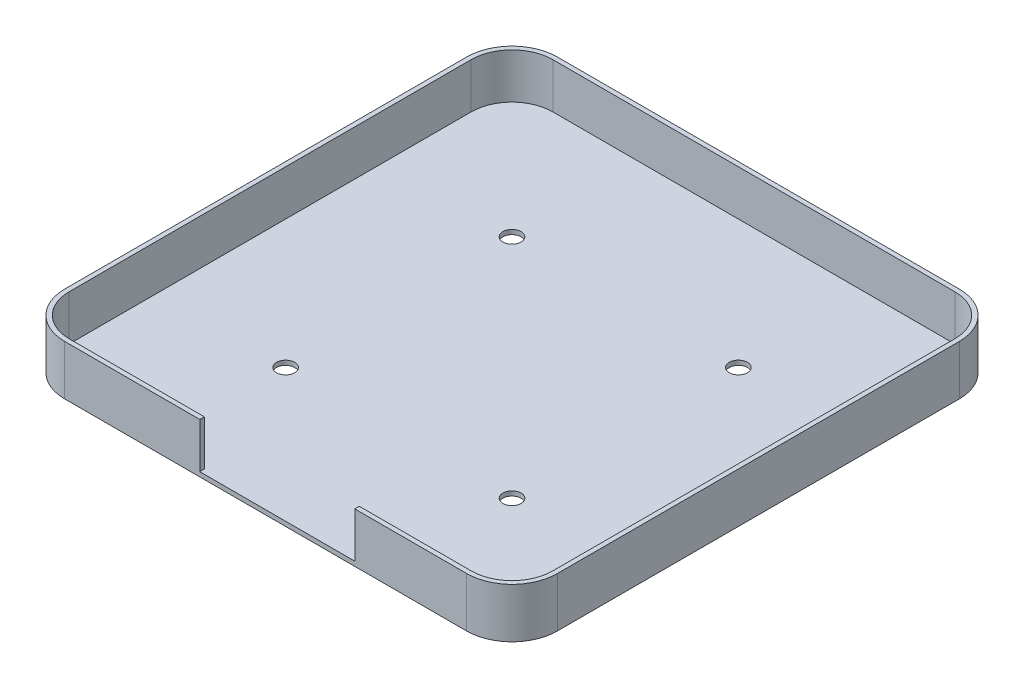
ISO-10303-21;
HEADER;
FILE_DESCRIPTION(('STEP AP214'),'2;1');
FILE_NAME('part.step','',(''),(''),'','','');
FILE_SCHEMA(('AUTOMOTIVE_DESIGN { 1 0 10303 214 1 1 1 1 }'));
ENDSEC;
DATA;
#1=APPLICATION_CONTEXT('core data for automotive mechanical design processes');
#2=APPLICATION_PROTOCOL_DEFINITION('international standard','automotive_design',2000,#1);
#3=PRODUCT_CONTEXT('',#1,'mechanical');
#4=PRODUCT('Part','Part','',(#3));
#5=PRODUCT_RELATED_PRODUCT_CATEGORY('part','',(#4));
#6=PRODUCT_DEFINITION_FORMATION('','',#4);
#7=PRODUCT_DEFINITION_CONTEXT('part definition',#1,'design');
#8=PRODUCT_DEFINITION('design','',#6,#7);
#9=PRODUCT_DEFINITION_SHAPE('','',#8);
#10=(LENGTH_UNIT() NAMED_UNIT(*) SI_UNIT(.MILLI.,.METRE.));
#11=(NAMED_UNIT(*) PLANE_ANGLE_UNIT() SI_UNIT($,.RADIAN.));
#12=(NAMED_UNIT(*) SI_UNIT($,.STERADIAN.) SOLID_ANGLE_UNIT());
#13=UNCERTAINTY_MEASURE_WITH_UNIT(LENGTH_MEASURE(1.E-05),#10,'distance_accuracy_value','');
#14=(GEOMETRIC_REPRESENTATION_CONTEXT(3) GLOBAL_UNCERTAINTY_ASSIGNED_CONTEXT((#13)) GLOBAL_UNIT_ASSIGNED_CONTEXT((#10,
#11,#12)) REPRESENTATION_CONTEXT('',''));
#15=CARTESIAN_POINT('',(0.,0.,0.));
#16=DIRECTION('',(0.,0.,1.));
#17=DIRECTION('',(1.,0.,0.));
#18=AXIS2_PLACEMENT_3D('',#15,#16,#17);
#19=CARTESIAN_POINT('',(0.,11.,53.4));
#20=DIRECTION('',(0.,0.,-1.));
#21=DIRECTION('',(-1.,0.,0.));
#22=AXIS2_PLACEMENT_3D('',#19,#20,#21);
#23=PLANE('',#22);
#24=DIRECTION('',(1.,0.,0.));
#25=VECTOR('',#24,1.);
#26=CARTESIAN_POINT('',(0.,1.,53.4));
#27=LINE('',#26,#25);
#28=CARTESIAN_POINT('',(19.6726017943409,1.,53.4));
#29=VERTEX_POINT('',#28);
#30=CARTESIAN_POINT('',(44.3999999999999,1.,53.4));
#31=VERTEX_POINT('',#30);
#32=EDGE_CURVE('E204',#29,#31,#27,.T.);
#33=ORIENTED_EDGE('',*,*,#32,.F.);
#34=DIRECTION('',(0.,-1.,0.));
#35=VECTOR('',#34,1.);
#36=CARTESIAN_POINT('',(19.6726017943409,0.,53.4));
#37=LINE('',#36,#35);
#38=CARTESIAN_POINT('',(19.6726017943409,11.,53.4));
#39=VERTEX_POINT('',#38);
#40=EDGE_CURVE('E496',#39,#29,#37,.T.);
#41=ORIENTED_EDGE('',*,*,#40,.F.);
#42=DIRECTION('',(1.,0.,0.));
#43=VECTOR('',#42,1.);
#44=CARTESIAN_POINT('',(0.,11.,53.4));
#45=LINE('',#44,#43);
#46=CARTESIAN_POINT('',(44.3999999999999,11.,53.4));
#47=VERTEX_POINT('',#46);
#48=EDGE_CURVE('E326',#39,#47,#45,.T.);
#49=ORIENTED_EDGE('',*,*,#48,.T.);
#50=DIRECTION('',(0.,-1.,0.));
#51=VECTOR('',#50,1.);
#52=CARTESIAN_POINT('',(44.3999999999999,11.,53.4));
#53=LINE('',#52,#51);
#54=EDGE_CURVE('E298',#47,#31,#53,.T.);
#55=ORIENTED_EDGE('',*,*,#54,.T.);
#56=EDGE_LOOP('',(#33,#41,#49,#55));
#57=FACE_BOUND('',#56,.T.);
#58=ADVANCED_FACE('F38',(#57),#23,.T.);
#59=CARTESIAN_POINT('',(-25.,1.,-25.));
#60=DIRECTION('',(0.,-1.,0.));
#61=DIRECTION('',(0.,0.,-1.));
#62=AXIS2_PLACEMENT_3D('',#59,#60,#61);
#63=CYLINDRICAL_SURFACE('',#62,2.);
#64=CARTESIAN_POINT('',(-25.,1.,-25.));
#65=DIRECTION('',(0.,1.,0.));
#66=DIRECTION('',(0.,0.,1.));
#67=AXIS2_PLACEMENT_3D('',#64,#65,#66);
#68=CIRCLE('',#67,2.);
#69=CARTESIAN_POINT('',(-25.,1.,-23.));
#70=VERTEX_POINT('',#69);
#71=EDGE_CURVE('E47',#70,#70,#68,.T.);
#72=ORIENTED_EDGE('',*,*,#71,.T.);
#73=EDGE_LOOP('',(#72));
#74=FACE_BOUND('',#73,.T.);
#75=CARTESIAN_POINT('',(-25.,0.,-25.));
#76=DIRECTION('',(0.,1.,0.));
#77=DIRECTION('',(0.,0.,1.));
#78=AXIS2_PLACEMENT_3D('',#75,#76,#77);
#79=CIRCLE('',#78,2.);
#80=CARTESIAN_POINT('',(-25.,0.,-23.));
#81=VERTEX_POINT('',#80);
#82=EDGE_CURVE('E236',#81,#81,#79,.T.);
#83=ORIENTED_EDGE('',*,*,#82,.F.);
#84=EDGE_LOOP('',(#83));
#85=FACE_BOUND('',#84,.T.);
#86=ADVANCED_FACE('F399',(#74,#85),#63,.F.);
#87=CARTESIAN_POINT('',(25.,1.,-25.));
#88=DIRECTION('',(0.,-1.,0.));
#89=DIRECTION('',(0.,0.,-1.));
#90=AXIS2_PLACEMENT_3D('',#87,#88,#89);
#91=CYLINDRICAL_SURFACE('',#90,2.);
#92=CARTESIAN_POINT('',(25.,1.,-25.));
#93=DIRECTION('',(0.,1.,0.));
#94=DIRECTION('',(0.,0.,1.));
#95=AXIS2_PLACEMENT_3D('',#92,#93,#94);
#96=CIRCLE('',#95,2.);
#97=CARTESIAN_POINT('',(25.,1.,-23.));
#98=VERTEX_POINT('',#97);
#99=EDGE_CURVE('E225',#98,#98,#96,.T.);
#100=ORIENTED_EDGE('',*,*,#99,.T.);
#101=EDGE_LOOP('',(#100));
#102=FACE_BOUND('',#101,.T.);
#103=CARTESIAN_POINT('',(25.,0.,-25.));
#104=DIRECTION('',(0.,1.,0.));
#105=DIRECTION('',(0.,0.,1.));
#106=AXIS2_PLACEMENT_3D('',#103,#104,#105);
#107=CIRCLE('',#106,2.);
#108=CARTESIAN_POINT('',(25.,0.,-23.));
#109=VERTEX_POINT('',#108);
#110=EDGE_CURVE('E233',#109,#109,#107,.T.);
#111=ORIENTED_EDGE('',*,*,#110,.F.);
#112=EDGE_LOOP('',(#111));
#113=FACE_BOUND('',#112,.T.);
#114=ADVANCED_FACE('F404',(#102,#113),#91,.F.);
#115=CARTESIAN_POINT('',(25.,1.,25.));
#116=DIRECTION('',(0.,-1.,0.));
#117=DIRECTION('',(0.,0.,-1.));
#118=AXIS2_PLACEMENT_3D('',#115,#116,#117);
#119=CYLINDRICAL_SURFACE('',#118,2.);
#120=CARTESIAN_POINT('',(25.,1.,25.));
#121=DIRECTION('',(0.,1.,0.));
#122=DIRECTION('',(0.,0.,1.));
#123=AXIS2_PLACEMENT_3D('',#120,#121,#122);
#124=CIRCLE('',#123,2.);
#125=CARTESIAN_POINT('',(25.,1.,27.));
#126=VERTEX_POINT('',#125);
#127=EDGE_CURVE('E222',#126,#126,#124,.F.);
#128=ORIENTED_EDGE('',*,*,#127,.F.);
#129=EDGE_LOOP('',(#128));
#130=FACE_BOUND('',#129,.T.);
#131=CARTESIAN_POINT('',(25.,0.,25.));
#132=DIRECTION('',(0.,1.,0.));
#133=DIRECTION('',(0.,0.,1.));
#134=AXIS2_PLACEMENT_3D('',#131,#132,#133);
#135=CIRCLE('',#134,2.);
#136=CARTESIAN_POINT('',(25.,0.,27.));
#137=VERTEX_POINT('',#136);
#138=EDGE_CURVE('E230',#137,#137,#135,.F.);
#139=ORIENTED_EDGE('',*,*,#138,.T.);
#140=EDGE_LOOP('',(#139));
#141=FACE_BOUND('',#140,.T.);
#142=ADVANCED_FACE('F40',(#130,#141),#119,.F.);
#143=CARTESIAN_POINT('',(-25.,1.,25.));
#144=DIRECTION('',(0.,-1.,0.));
#145=DIRECTION('',(0.,0.,-1.));
#146=AXIS2_PLACEMENT_3D('',#143,#144,#145);
#147=CYLINDRICAL_SURFACE('',#146,2.);
#148=CARTESIAN_POINT('',(-25.,1.,25.));
#149=DIRECTION('',(0.,1.,0.));
#150=DIRECTION('',(0.,0.,1.));
#151=AXIS2_PLACEMENT_3D('',#148,#149,#150);
#152=CIRCLE('',#151,2.);
#153=CARTESIAN_POINT('',(-25.,1.,27.));
#154=VERTEX_POINT('',#153);
#155=EDGE_CURVE('E11',#154,#154,#152,.F.);
#156=ORIENTED_EDGE('',*,*,#155,.F.);
#157=EDGE_LOOP('',(#156));
#158=FACE_BOUND('',#157,.T.);
#159=CARTESIAN_POINT('',(-25.,0.,25.));
#160=DIRECTION('',(0.,1.,0.));
#161=DIRECTION('',(0.,0.,1.));
#162=AXIS2_PLACEMENT_3D('',#159,#160,#161);
#163=CIRCLE('',#162,2.);
#164=CARTESIAN_POINT('',(-25.,0.,27.));
#165=VERTEX_POINT('',#164);
#166=EDGE_CURVE('E42',#165,#165,#163,.F.);
#167=ORIENTED_EDGE('',*,*,#166,.T.);
#168=EDGE_LOOP('',(#167));
#169=FACE_BOUND('',#168,.T.);
#170=ADVANCED_FACE('F420',(#158,#169),#147,.F.);
#171=CARTESIAN_POINT('',(0.,1.,0.));
#172=DIRECTION('',(0.,1.,0.));
#173=DIRECTION('',(0.,0.,1.));
#174=AXIS2_PLACEMENT_3D('',#171,#172,#173);
#175=PLANE('',#174);
#176=CARTESIAN_POINT('',(-44.4,1.,44.4));
#177=DIRECTION('',(0.,1.,0.));
#178=DIRECTION('',(0.,0.,1.));
#179=AXIS2_PLACEMENT_3D('',#176,#177,#178);
#180=CIRCLE('',#179,9.);
#181=CARTESIAN_POINT('',(-44.3999999999999,1.,53.4));
#182=VERTEX_POINT('',#181);
#183=CARTESIAN_POINT('',(-53.4,1.,44.3999999999999));
#184=VERTEX_POINT('',#183);
#185=EDGE_CURVE('E202',#182,#184,#180,.F.);
#186=ORIENTED_EDGE('',*,*,#185,.F.);
#187=CARTESIAN_POINT('',(-14.5573982056591,1.,53.4));
#188=VERTEX_POINT('',#187);
#189=EDGE_CURVE('E193',#182,#188,#27,.T.);
#190=ORIENTED_EDGE('',*,*,#189,.T.);
#191=DIRECTION('',(0.,0.,1.));
#192=VECTOR('',#191,1.);
#193=CARTESIAN_POINT('',(-14.5573982056591,1.,17.7391965878501));
#194=LINE('',#193,#192);
#195=CARTESIAN_POINT('',(-14.5573982056591,1.,54.4));
#196=VERTEX_POINT('',#195);
#197=EDGE_CURVE('E177',#188,#196,#194,.T.);
#198=ORIENTED_EDGE('',*,*,#197,.T.);
#199=DIRECTION('',(-1.,0.,0.));
#200=VECTOR('',#199,1.);
#201=CARTESIAN_POINT('',(0.,1.,54.4));
#202=LINE('',#201,#200);
#203=CARTESIAN_POINT('',(19.6726017943409,1.,54.4));
#204=VERTEX_POINT('',#203);
#205=EDGE_CURVE('E499',#204,#196,#202,.T.);
#206=ORIENTED_EDGE('',*,*,#205,.F.);
#207=DIRECTION('',(0.,0.,1.));
#208=VECTOR('',#207,1.);
#209=CARTESIAN_POINT('',(19.6726017943409,1.,17.7391965878501));
#210=LINE('',#209,#208);
#211=EDGE_CURVE('E188',#29,#204,#210,.T.);
#212=ORIENTED_EDGE('',*,*,#211,.F.);
#213=ORIENTED_EDGE('',*,*,#32,.T.);
#214=CARTESIAN_POINT('',(44.4,1.,44.4));
#215=DIRECTION('',(0.,1.,0.));
#216=DIRECTION('',(0.,0.,1.));
#217=AXIS2_PLACEMENT_3D('',#214,#215,#216);
#218=CIRCLE('',#217,9.);
#219=CARTESIAN_POINT('',(53.4,1.,44.3999999999999));
#220=VERTEX_POINT('',#219);
#221=EDGE_CURVE('E203',#31,#220,#218,.T.);
#222=ORIENTED_EDGE('',*,*,#221,.T.);
#223=DIRECTION('',(0.,0.,-1.));
#224=VECTOR('',#223,1.);
#225=CARTESIAN_POINT('',(53.4,1.,0.));
#226=LINE('',#225,#224);
#227=CARTESIAN_POINT('',(53.4,1.,-44.3999999999999));
#228=VERTEX_POINT('',#227);
#229=EDGE_CURVE('E207',#220,#228,#226,.T.);
#230=ORIENTED_EDGE('',*,*,#229,.T.);
#231=CARTESIAN_POINT('',(44.4,1.,-44.4));
#232=DIRECTION('',(0.,1.,0.));
#233=DIRECTION('',(0.,0.,1.));
#234=AXIS2_PLACEMENT_3D('',#231,#232,#233);
#235=CIRCLE('',#234,9.);
#236=CARTESIAN_POINT('',(44.3999999999999,1.,-53.4));
#237=VERTEX_POINT('',#236);
#238=EDGE_CURVE('E214',#237,#228,#235,.F.);
#239=ORIENTED_EDGE('',*,*,#238,.F.);
#240=DIRECTION('',(1.,0.,0.));
#241=VECTOR('',#240,1.);
#242=CARTESIAN_POINT('',(0.,1.,-53.4));
#243=LINE('',#242,#241);
#244=CARTESIAN_POINT('',(-44.3999999999999,1.,-53.4));
#245=VERTEX_POINT('',#244);
#246=EDGE_CURVE('E216',#245,#237,#243,.T.);
#247=ORIENTED_EDGE('',*,*,#246,.F.);
#248=CARTESIAN_POINT('',(-44.4,1.,-44.4));
#249=DIRECTION('',(0.,1.,0.));
#250=DIRECTION('',(0.,0.,1.));
#251=AXIS2_PLACEMENT_3D('',#248,#249,#250);
#252=CIRCLE('',#251,9.);
#253=CARTESIAN_POINT('',(-53.4,1.,-44.3999999999999));
#254=VERTEX_POINT('',#253);
#255=EDGE_CURVE('E218',#254,#245,#252,.F.);
#256=ORIENTED_EDGE('',*,*,#255,.F.);
#257=DIRECTION('',(0.,0.,-1.));
#258=VECTOR('',#257,1.);
#259=CARTESIAN_POINT('',(-53.4,1.,0.));
#260=LINE('',#259,#258);
#261=EDGE_CURVE('E220',#184,#254,#260,.T.);
#262=ORIENTED_EDGE('',*,*,#261,.F.);
#263=EDGE_LOOP('',(#186,#190,#198,#206,#212,#213,#222,#230,#239,#247,#256,#262));
#264=FACE_BOUND('',#263,.T.);
#265=ORIENTED_EDGE('',*,*,#127,.T.);
#266=EDGE_LOOP('',(#265));
#267=FACE_BOUND('',#266,.T.);
#268=ORIENTED_EDGE('',*,*,#99,.F.);
#269=EDGE_LOOP('',(#268));
#270=FACE_BOUND('',#269,.T.);
#271=ORIENTED_EDGE('',*,*,#71,.F.);
#272=EDGE_LOOP('',(#271));
#273=FACE_BOUND('',#272,.T.);
#274=ORIENTED_EDGE('',*,*,#155,.T.);
#275=EDGE_LOOP('',(#274));
#276=FACE_BOUND('',#275,.T.);
#277=ADVANCED_FACE('F199',(#264,#267,#270,#273,#276),#175,.T.);
#278=CARTESIAN_POINT('',(0.,0.,0.));
#279=DIRECTION('',(0.,1.,0.));
#280=DIRECTION('',(0.,0.,1.));
#281=AXIS2_PLACEMENT_3D('',#278,#279,#280);
#282=PLANE('',#281);
#283=ORIENTED_EDGE('',*,*,#138,.F.);
#284=EDGE_LOOP('',(#283));
#285=FACE_BOUND('',#284,.T.);
#286=ORIENTED_EDGE('',*,*,#110,.T.);
#287=EDGE_LOOP('',(#286));
#288=FACE_BOUND('',#287,.T.);
#289=ORIENTED_EDGE('',*,*,#82,.T.);
#290=EDGE_LOOP('',(#289));
#291=FACE_BOUND('',#290,.T.);
#292=ORIENTED_EDGE('',*,*,#166,.F.);
#293=EDGE_LOOP('',(#292));
#294=FACE_BOUND('',#293,.T.);
#295=CARTESIAN_POINT('',(-44.4,0.,-44.4));
#296=DIRECTION('',(0.,1.,0.));
#297=DIRECTION('',(0.,0.,1.));
#298=AXIS2_PLACEMENT_3D('',#295,#296,#297);
#299=CIRCLE('',#298,10.);
#300=CARTESIAN_POINT('',(-54.4,0.,-44.3999999999999));
#301=VERTEX_POINT('',#300);
#302=CARTESIAN_POINT('',(-44.3999999999999,0.,-54.4));
#303=VERTEX_POINT('',#302);
#304=EDGE_CURVE('E332',#301,#303,#299,.F.);
#305=ORIENTED_EDGE('',*,*,#304,.T.);
#306=DIRECTION('',(1.,0.,0.));
#307=VECTOR('',#306,1.);
#308=CARTESIAN_POINT('',(0.,0.,-54.4));
#309=LINE('',#308,#307);
#310=CARTESIAN_POINT('',(44.3999999999999,0.,-54.4));
#311=VERTEX_POINT('',#310);
#312=EDGE_CURVE('E310',#303,#311,#309,.T.);
#313=ORIENTED_EDGE('',*,*,#312,.T.);
#314=CARTESIAN_POINT('',(44.4,0.,-44.4));
#315=DIRECTION('',(0.,1.,0.));
#316=DIRECTION('',(0.,0.,1.));
#317=AXIS2_PLACEMENT_3D('',#314,#315,#316);
#318=CIRCLE('',#317,10.);
#319=CARTESIAN_POINT('',(54.4,0.,-44.3999999999999));
#320=VERTEX_POINT('',#319);
#321=EDGE_CURVE('E348',#311,#320,#318,.F.);
#322=ORIENTED_EDGE('',*,*,#321,.T.);
#323=DIRECTION('',(0.,0.,-1.));
#324=VECTOR('',#323,1.);
#325=CARTESIAN_POINT('',(54.4,0.,0.));
#326=LINE('',#325,#324);
#327=CARTESIAN_POINT('',(54.4,0.,44.3999999999999));
#328=VERTEX_POINT('',#327);
#329=EDGE_CURVE('E346',#328,#320,#326,.T.);
#330=ORIENTED_EDGE('',*,*,#329,.F.);
#331=CARTESIAN_POINT('',(44.4,0.,44.4));
#332=DIRECTION('',(0.,1.,0.));
#333=DIRECTION('',(0.,0.,1.));
#334=AXIS2_PLACEMENT_3D('',#331,#332,#333);
#335=CIRCLE('',#334,10.);
#336=CARTESIAN_POINT('',(44.3999999999999,0.,54.4));
#337=VERTEX_POINT('',#336);
#338=EDGE_CURVE('E344',#337,#328,#335,.T.);
#339=ORIENTED_EDGE('',*,*,#338,.F.);
#340=DIRECTION('',(1.,0.,0.));
#341=VECTOR('',#340,1.);
#342=CARTESIAN_POINT('',(0.,0.,54.4));
#343=LINE('',#342,#341);
#344=CARTESIAN_POINT('',(-44.3999999999999,0.,54.4));
#345=VERTEX_POINT('',#344);
#346=EDGE_CURVE('E342',#345,#337,#343,.T.);
#347=ORIENTED_EDGE('',*,*,#346,.F.);
#348=CARTESIAN_POINT('',(-44.4,0.,44.4));
#349=DIRECTION('',(0.,1.,0.));
#350=DIRECTION('',(0.,0.,1.));
#351=AXIS2_PLACEMENT_3D('',#348,#349,#350);
#352=CIRCLE('',#351,10.);
#353=CARTESIAN_POINT('',(-54.4,0.,44.3999999999999));
#354=VERTEX_POINT('',#353);
#355=EDGE_CURVE('E339',#345,#354,#352,.F.);
#356=ORIENTED_EDGE('',*,*,#355,.T.);
#357=DIRECTION('',(0.,0.,-1.));
#358=VECTOR('',#357,1.);
#359=CARTESIAN_POINT('',(-54.4,0.,0.));
#360=LINE('',#359,#358);
#361=EDGE_CURVE('E335',#354,#301,#360,.T.);
#362=ORIENTED_EDGE('',*,*,#361,.T.);
#363=EDGE_LOOP('',(#305,#313,#322,#330,#339,#347,#356,#362));
#364=FACE_BOUND('',#363,.T.);
#365=ADVANCED_FACE('F410',(#285,#288,#291,#294,#364),#282,.F.);
#366=DIRECTION('',(0.,-1.,0.));
#367=VECTOR('',#366,1.);
#368=CARTESIAN_POINT('',(-14.5573982056591,0.,53.4));
#369=LINE('',#368,#367);
#370=CARTESIAN_POINT('',(-14.5573982056591,11.,53.4));
#371=VERTEX_POINT('',#370);
#372=EDGE_CURVE('E180',#371,#188,#369,.T.);
#373=ORIENTED_EDGE('',*,*,#372,.T.);
#374=ORIENTED_EDGE('',*,*,#189,.F.);
#375=DIRECTION('',(0.,-1.,0.));
#376=VECTOR('',#375,1.);
#377=CARTESIAN_POINT('',(-44.3999999999999,11.,53.4));
#378=LINE('',#377,#376);
#379=CARTESIAN_POINT('',(-44.3999999999999,11.,53.4));
#380=VERTEX_POINT('',#379);
#381=EDGE_CURVE('E234',#380,#182,#378,.T.);
#382=ORIENTED_EDGE('',*,*,#381,.F.);
#383=EDGE_CURVE('E196',#380,#371,#45,.T.);
#384=ORIENTED_EDGE('',*,*,#383,.T.);
#385=EDGE_LOOP('',(#373,#374,#382,#384));
#386=FACE_BOUND('',#385,.T.);
#387=ADVANCED_FACE('F192',(#386),#23,.T.);
#388=CARTESIAN_POINT('',(-44.4,11.,44.4));
#389=DIRECTION('',(0.,-1.,0.));
#390=DIRECTION('',(0.,0.,-1.));
#391=AXIS2_PLACEMENT_3D('',#388,#389,#390);
#392=CYLINDRICAL_SURFACE('',#391,9.);
#393=ORIENTED_EDGE('',*,*,#185,.T.);
#394=DIRECTION('',(0.,-1.,0.));
#395=VECTOR('',#394,1.);
#396=CARTESIAN_POINT('',(-53.4,11.,44.3999999999999));
#397=LINE('',#396,#395);
#398=CARTESIAN_POINT('',(-53.4,11.,44.3999999999999));
#399=VERTEX_POINT('',#398);
#400=EDGE_CURVE('E248',#399,#184,#397,.T.);
#401=ORIENTED_EDGE('',*,*,#400,.F.);
#402=CARTESIAN_POINT('',(-44.4,11.,44.4));
#403=DIRECTION('',(0.,1.,0.));
#404=DIRECTION('',(0.,0.,1.));
#405=AXIS2_PLACEMENT_3D('',#402,#403,#404);
#406=CIRCLE('',#405,9.);
#407=EDGE_CURVE('E383',#380,#399,#406,.F.);
#408=ORIENTED_EDGE('',*,*,#407,.F.);
#409=ORIENTED_EDGE('',*,*,#381,.T.);
#410=EDGE_LOOP('',(#393,#401,#408,#409));
#411=FACE_BOUND('',#410,.T.);
#412=ADVANCED_FACE('F246',(#411),#392,.F.);
#413=CARTESIAN_POINT('',(-53.4,11.,0.));
#414=DIRECTION('',(-1.,0.,0.));
#415=DIRECTION('',(0.,0.,1.));
#416=AXIS2_PLACEMENT_3D('',#413,#414,#415);
#417=PLANE('',#416);
#418=ORIENTED_EDGE('',*,*,#261,.T.);
#419=DIRECTION('',(0.,-1.,0.));
#420=VECTOR('',#419,1.);
#421=CARTESIAN_POINT('',(-53.4,11.,-44.3999999999999));
#422=LINE('',#421,#420);
#423=CARTESIAN_POINT('',(-53.4,11.,-44.3999999999999));
#424=VERTEX_POINT('',#423);
#425=EDGE_CURVE('E256',#424,#254,#422,.T.);
#426=ORIENTED_EDGE('',*,*,#425,.F.);
#427=DIRECTION('',(0.,0.,-1.));
#428=VECTOR('',#427,1.);
#429=CARTESIAN_POINT('',(-53.4,11.,0.));
#430=LINE('',#429,#428);
#431=EDGE_CURVE('E254',#399,#424,#430,.T.);
#432=ORIENTED_EDGE('',*,*,#431,.F.);
#433=ORIENTED_EDGE('',*,*,#400,.T.);
#434=EDGE_LOOP('',(#418,#426,#432,#433));
#435=FACE_BOUND('',#434,.T.);
#436=ADVANCED_FACE('F250',(#435),#417,.F.);
#437=CARTESIAN_POINT('',(-44.4,11.,-44.4));
#438=DIRECTION('',(0.,-1.,0.));
#439=DIRECTION('',(0.,0.,-1.));
#440=AXIS2_PLACEMENT_3D('',#437,#438,#439);
#441=CYLINDRICAL_SURFACE('',#440,9.);
#442=ORIENTED_EDGE('',*,*,#255,.T.);
#443=DIRECTION('',(0.,-1.,0.));
#444=VECTOR('',#443,1.);
#445=CARTESIAN_POINT('',(-44.3999999999999,11.,-53.4));
#446=LINE('',#445,#444);
#447=CARTESIAN_POINT('',(-44.3999999999999,11.,-53.4));
#448=VERTEX_POINT('',#447);
#449=EDGE_CURVE('E265',#448,#245,#446,.T.);
#450=ORIENTED_EDGE('',*,*,#449,.F.);
#451=CARTESIAN_POINT('',(-44.4,11.,-44.4));
#452=DIRECTION('',(0.,1.,0.));
#453=DIRECTION('',(0.,0.,1.));
#454=AXIS2_PLACEMENT_3D('',#451,#452,#453);
#455=CIRCLE('',#454,9.);
#456=EDGE_CURVE('E386',#424,#448,#455,.F.);
#457=ORIENTED_EDGE('',*,*,#456,.F.);
#458=ORIENTED_EDGE('',*,*,#425,.T.);
#459=EDGE_LOOP('',(#442,#450,#457,#458));
#460=FACE_BOUND('',#459,.T.);
#461=ADVANCED_FACE('F264',(#460),#441,.F.);
#462=CARTESIAN_POINT('',(0.,11.,-53.4));
#463=DIRECTION('',(0.,0.,-1.));
#464=DIRECTION('',(-1.,0.,0.));
#465=AXIS2_PLACEMENT_3D('',#462,#463,#464);
#466=PLANE('',#465);
#467=ORIENTED_EDGE('',*,*,#246,.T.);
#468=DIRECTION('',(0.,-1.,0.));
#469=VECTOR('',#468,1.);
#470=CARTESIAN_POINT('',(44.3999999999999,11.,-53.4));
#471=LINE('',#470,#469);
#472=CARTESIAN_POINT('',(44.3999999999999,11.,-53.4));
#473=VERTEX_POINT('',#472);
#474=EDGE_CURVE('E273',#473,#237,#471,.T.);
#475=ORIENTED_EDGE('',*,*,#474,.F.);
#476=DIRECTION('',(1.,0.,0.));
#477=VECTOR('',#476,1.);
#478=CARTESIAN_POINT('',(0.,11.,-53.4));
#479=LINE('',#478,#477);
#480=EDGE_CURVE('E271',#448,#473,#479,.T.);
#481=ORIENTED_EDGE('',*,*,#480,.F.);
#482=ORIENTED_EDGE('',*,*,#449,.T.);
#483=EDGE_LOOP('',(#467,#475,#481,#482));
#484=FACE_BOUND('',#483,.T.);
#485=ADVANCED_FACE('F267',(#484),#466,.F.);
#486=CARTESIAN_POINT('',(44.4,11.,-44.4));
#487=DIRECTION('',(0.,-1.,0.));
#488=DIRECTION('',(0.,0.,-1.));
#489=AXIS2_PLACEMENT_3D('',#486,#487,#488);
#490=CYLINDRICAL_SURFACE('',#489,9.);
#491=ORIENTED_EDGE('',*,*,#238,.T.);
#492=DIRECTION('',(0.,-1.,0.));
#493=VECTOR('',#492,1.);
#494=CARTESIAN_POINT('',(53.4,11.,-44.3999999999999));
#495=LINE('',#494,#493);
#496=CARTESIAN_POINT('',(53.4,11.,-44.3999999999999));
#497=VERTEX_POINT('',#496);
#498=EDGE_CURVE('E276',#497,#228,#495,.T.);
#499=ORIENTED_EDGE('',*,*,#498,.F.);
#500=CARTESIAN_POINT('',(44.4,11.,-44.4));
#501=DIRECTION('',(0.,1.,0.));
#502=DIRECTION('',(0.,0.,1.));
#503=AXIS2_PLACEMENT_3D('',#500,#501,#502);
#504=CIRCLE('',#503,9.);
#505=EDGE_CURVE('E328',#473,#497,#504,.F.);
#506=ORIENTED_EDGE('',*,*,#505,.F.);
#507=ORIENTED_EDGE('',*,*,#474,.T.);
#508=EDGE_LOOP('',(#491,#499,#506,#507));
#509=FACE_BOUND('',#508,.T.);
#510=ADVANCED_FACE('F388',(#509),#490,.F.);
#511=CARTESIAN_POINT('',(53.4,11.,0.));
#512=DIRECTION('',(-1.,0.,0.));
#513=DIRECTION('',(0.,0.,1.));
#514=AXIS2_PLACEMENT_3D('',#511,#512,#513);
#515=PLANE('',#514);
#516=ORIENTED_EDGE('',*,*,#498,.T.);
#517=ORIENTED_EDGE('',*,*,#229,.F.);
#518=DIRECTION('',(0.,-1.,0.));
#519=VECTOR('',#518,1.);
#520=CARTESIAN_POINT('',(53.4,11.,44.3999999999999));
#521=LINE('',#520,#519);
#522=CARTESIAN_POINT('',(53.4,11.,44.3999999999999));
#523=VERTEX_POINT('',#522);
#524=EDGE_CURVE('E63',#523,#220,#521,.T.);
#525=ORIENTED_EDGE('',*,*,#524,.F.);
#526=DIRECTION('',(0.,0.,-1.));
#527=VECTOR('',#526,1.);
#528=CARTESIAN_POINT('',(53.4,11.,0.));
#529=LINE('',#528,#527);
#530=EDGE_CURVE('E318',#523,#497,#529,.T.);
#531=ORIENTED_EDGE('',*,*,#530,.T.);
#532=EDGE_LOOP('',(#516,#517,#525,#531));
#533=FACE_BOUND('',#532,.T.);
#534=ADVANCED_FACE('F316',(#533),#515,.T.);
#535=CARTESIAN_POINT('',(-44.4,11.,-44.4));
#536=DIRECTION('',(0.,-1.,0.));
#537=DIRECTION('',(0.,0.,-1.));
#538=AXIS2_PLACEMENT_3D('',#535,#536,#537);
#539=CYLINDRICAL_SURFACE('',#538,10.);
#540=ORIENTED_EDGE('',*,*,#304,.F.);
#541=DIRECTION('',(0.,-1.,0.));
#542=VECTOR('',#541,1.);
#543=CARTESIAN_POINT('',(-54.4,11.,-44.3999999999999));
#544=LINE('',#543,#542);
#545=CARTESIAN_POINT('',(-54.4,11.,-44.3999999999999));
#546=VERTEX_POINT('',#545);
#547=EDGE_CURVE('E297',#546,#301,#544,.T.);
#548=ORIENTED_EDGE('',*,*,#547,.F.);
#549=CARTESIAN_POINT('',(-44.4,11.,-44.4));
#550=DIRECTION('',(0.,1.,0.));
#551=DIRECTION('',(0.,0.,1.));
#552=AXIS2_PLACEMENT_3D('',#549,#550,#551);
#553=CIRCLE('',#552,10.);
#554=CARTESIAN_POINT('',(-44.3999999999999,11.,-54.4));
#555=VERTEX_POINT('',#554);
#556=EDGE_CURVE('E354',#546,#555,#553,.F.);
#557=ORIENTED_EDGE('',*,*,#556,.T.);
#558=DIRECTION('',(0.,-1.,0.));
#559=VECTOR('',#558,1.);
#560=CARTESIAN_POINT('',(-44.3999999999999,11.,-54.4));
#561=LINE('',#560,#559);
#562=EDGE_CURVE('E281',#555,#303,#561,.T.);
#563=ORIENTED_EDGE('',*,*,#562,.T.);
#564=EDGE_LOOP('',(#540,#548,#557,#563));
#565=FACE_BOUND('',#564,.T.);
#566=ADVANCED_FACE('F395',(#565),#539,.T.);
#567=CARTESIAN_POINT('',(-54.4,11.,0.));
#568=DIRECTION('',(-1.,0.,0.));
#569=DIRECTION('',(0.,0.,1.));
#570=AXIS2_PLACEMENT_3D('',#567,#568,#569);
#571=PLANE('',#570);
#572=ORIENTED_EDGE('',*,*,#361,.F.);
#573=DIRECTION('',(0.,-1.,0.));
#574=VECTOR('',#573,1.);
#575=CARTESIAN_POINT('',(-54.4,11.,44.3999999999999));
#576=LINE('',#575,#574);
#577=CARTESIAN_POINT('',(-54.4,11.,44.3999999999999));
#578=VERTEX_POINT('',#577);
#579=EDGE_CURVE('E296',#578,#354,#576,.T.);
#580=ORIENTED_EDGE('',*,*,#579,.F.);
#581=DIRECTION('',(0.,0.,-1.));
#582=VECTOR('',#581,1.);
#583=CARTESIAN_POINT('',(-54.4,11.,0.));
#584=LINE('',#583,#582);
#585=EDGE_CURVE('E357',#578,#546,#584,.T.);
#586=ORIENTED_EDGE('',*,*,#585,.T.);
#587=ORIENTED_EDGE('',*,*,#547,.T.);
#588=EDGE_LOOP('',(#572,#580,#586,#587));
#589=FACE_BOUND('',#588,.T.);
#590=ADVANCED_FACE('F463',(#589),#571,.T.);
#591=CARTESIAN_POINT('',(-44.4,11.,44.4));
#592=DIRECTION('',(0.,-1.,0.));
#593=DIRECTION('',(0.,0.,-1.));
#594=AXIS2_PLACEMENT_3D('',#591,#592,#593);
#595=CYLINDRICAL_SURFACE('',#594,10.);
#596=ORIENTED_EDGE('',*,*,#355,.F.);
#597=DIRECTION('',(0.,-1.,0.));
#598=VECTOR('',#597,1.);
#599=CARTESIAN_POINT('',(-44.3999999999999,11.,54.4));
#600=LINE('',#599,#598);
#601=CARTESIAN_POINT('',(-44.3999999999999,11.,54.4));
#602=VERTEX_POINT('',#601);
#603=EDGE_CURVE('E294',#602,#345,#600,.T.);
#604=ORIENTED_EDGE('',*,*,#603,.F.);
#605=CARTESIAN_POINT('',(-44.4,11.,44.4));
#606=DIRECTION('',(0.,1.,0.));
#607=DIRECTION('',(0.,0.,1.));
#608=AXIS2_PLACEMENT_3D('',#605,#606,#607);
#609=CIRCLE('',#608,10.);
#610=EDGE_CURVE('E362',#602,#578,#609,.F.);
#611=ORIENTED_EDGE('',*,*,#610,.T.);
#612=ORIENTED_EDGE('',*,*,#579,.T.);
#613=EDGE_LOOP('',(#596,#604,#611,#612));
#614=FACE_BOUND('',#613,.T.);
#615=ADVANCED_FACE('F461',(#614),#595,.T.);
#616=CARTESIAN_POINT('',(0.,11.,54.4));
#617=DIRECTION('',(0.,0.,-1.));
#618=DIRECTION('',(-1.,0.,0.));
#619=AXIS2_PLACEMENT_3D('',#616,#617,#618);
#620=PLANE('',#619);
#621=ORIENTED_EDGE('',*,*,#205,.T.);
#622=DIRECTION('',(0.,-1.,0.));
#623=VECTOR('',#622,1.);
#624=CARTESIAN_POINT('',(-14.5573982056591,0.,54.4));
#625=LINE('',#624,#623);
#626=CARTESIAN_POINT('',(-14.5573982056591,11.,54.4));
#627=VERTEX_POINT('',#626);
#628=EDGE_CURVE('E183',#627,#196,#625,.T.);
#629=ORIENTED_EDGE('',*,*,#628,.F.);
#630=DIRECTION('',(1.,0.,0.));
#631=VECTOR('',#630,1.);
#632=CARTESIAN_POINT('',(0.,11.,54.4));
#633=LINE('',#632,#631);
#634=EDGE_CURVE('E369',#602,#627,#633,.T.);
#635=ORIENTED_EDGE('',*,*,#634,.F.);
#636=ORIENTED_EDGE('',*,*,#603,.T.);
#637=ORIENTED_EDGE('',*,*,#346,.T.);
#638=DIRECTION('',(0.,-1.,0.));
#639=VECTOR('',#638,1.);
#640=CARTESIAN_POINT('',(44.3999999999999,11.,54.4));
#641=LINE('',#640,#639);
#642=CARTESIAN_POINT('',(44.3999999999999,11.,54.4));
#643=VERTEX_POINT('',#642);
#644=EDGE_CURVE('E291',#643,#337,#641,.T.);
#645=ORIENTED_EDGE('',*,*,#644,.F.);
#646=CARTESIAN_POINT('',(19.6726017943409,11.,54.4));
#647=VERTEX_POINT('',#646);
#648=EDGE_CURVE('E368',#647,#643,#633,.T.);
#649=ORIENTED_EDGE('',*,*,#648,.F.);
#650=DIRECTION('',(0.,-1.,0.));
#651=VECTOR('',#650,1.);
#652=CARTESIAN_POINT('',(19.6726017943409,0.,54.4));
#653=LINE('',#652,#651);
#654=EDGE_CURVE('E55',#647,#204,#653,.T.);
#655=ORIENTED_EDGE('',*,*,#654,.T.);
#656=EDGE_LOOP('',(#621,#629,#635,#636,#637,#645,#649,#655));
#657=FACE_BOUND('',#656,.T.);
#658=ADVANCED_FACE('F457',(#657),#620,.F.);
#659=CARTESIAN_POINT('',(44.4,11.,44.4));
#660=DIRECTION('',(0.,-1.,0.));
#661=DIRECTION('',(0.,0.,-1.));
#662=AXIS2_PLACEMENT_3D('',#659,#660,#661);
#663=CYLINDRICAL_SURFACE('',#662,10.);
#664=ORIENTED_EDGE('',*,*,#338,.T.);
#665=DIRECTION('',(0.,-1.,0.));
#666=VECTOR('',#665,1.);
#667=CARTESIAN_POINT('',(54.4,11.,44.3999999999999));
#668=LINE('',#667,#666);
#669=CARTESIAN_POINT('',(54.4,11.,44.3999999999999));
#670=VERTEX_POINT('',#669);
#671=EDGE_CURVE('E288',#670,#328,#668,.T.);
#672=ORIENTED_EDGE('',*,*,#671,.F.);
#673=CARTESIAN_POINT('',(44.4,11.,44.4));
#674=DIRECTION('',(0.,1.,0.));
#675=DIRECTION('',(0.,0.,1.));
#676=AXIS2_PLACEMENT_3D('',#673,#674,#675);
#677=CIRCLE('',#676,10.);
#678=EDGE_CURVE('E372',#643,#670,#677,.T.);
#679=ORIENTED_EDGE('',*,*,#678,.F.);
#680=ORIENTED_EDGE('',*,*,#644,.T.);
#681=EDGE_LOOP('',(#664,#672,#679,#680));
#682=FACE_BOUND('',#681,.T.);
#683=ADVANCED_FACE('F452',(#682),#663,.T.);
#684=CARTESIAN_POINT('',(54.4,11.,0.));
#685=DIRECTION('',(-1.,0.,0.));
#686=DIRECTION('',(0.,0.,1.));
#687=AXIS2_PLACEMENT_3D('',#684,#685,#686);
#688=PLANE('',#687);
#689=ORIENTED_EDGE('',*,*,#329,.T.);
#690=DIRECTION('',(0.,-1.,0.));
#691=VECTOR('',#690,1.);
#692=CARTESIAN_POINT('',(54.4,11.,-44.3999999999999));
#693=LINE('',#692,#691);
#694=CARTESIAN_POINT('',(54.4,11.,-44.3999999999999));
#695=VERTEX_POINT('',#694);
#696=EDGE_CURVE('E286',#695,#320,#693,.T.);
#697=ORIENTED_EDGE('',*,*,#696,.F.);
#698=DIRECTION('',(0.,0.,-1.));
#699=VECTOR('',#698,1.);
#700=CARTESIAN_POINT('',(54.4,11.,0.));
#701=LINE('',#700,#699);
#702=EDGE_CURVE('E374',#670,#695,#701,.T.);
#703=ORIENTED_EDGE('',*,*,#702,.F.);
#704=ORIENTED_EDGE('',*,*,#671,.T.);
#705=EDGE_LOOP('',(#689,#697,#703,#704));
#706=FACE_BOUND('',#705,.T.);
#707=ADVANCED_FACE('F446',(#706),#688,.F.);
#708=CARTESIAN_POINT('',(44.4,11.,-44.4));
#709=DIRECTION('',(0.,-1.,0.));
#710=DIRECTION('',(0.,0.,-1.));
#711=AXIS2_PLACEMENT_3D('',#708,#709,#710);
#712=CYLINDRICAL_SURFACE('',#711,10.);
#713=ORIENTED_EDGE('',*,*,#321,.F.);
#714=DIRECTION('',(0.,-1.,0.));
#715=VECTOR('',#714,1.);
#716=CARTESIAN_POINT('',(44.3999999999999,11.,-54.4));
#717=LINE('',#716,#715);
#718=CARTESIAN_POINT('',(44.3999999999999,11.,-54.4));
#719=VERTEX_POINT('',#718);
#720=EDGE_CURVE('E283',#719,#311,#717,.T.);
#721=ORIENTED_EDGE('',*,*,#720,.F.);
#722=CARTESIAN_POINT('',(44.4,11.,-44.4));
#723=DIRECTION('',(0.,1.,0.));
#724=DIRECTION('',(0.,0.,1.));
#725=AXIS2_PLACEMENT_3D('',#722,#723,#724);
#726=CIRCLE('',#725,10.);
#727=EDGE_CURVE('E376',#719,#695,#726,.F.);
#728=ORIENTED_EDGE('',*,*,#727,.T.);
#729=ORIENTED_EDGE('',*,*,#696,.T.);
#730=EDGE_LOOP('',(#713,#721,#728,#729));
#731=FACE_BOUND('',#730,.T.);
#732=ADVANCED_FACE('F442',(#731),#712,.T.);
#733=CARTESIAN_POINT('',(0.,11.,-54.4));
#734=DIRECTION('',(0.,0.,-1.));
#735=DIRECTION('',(-1.,0.,0.));
#736=AXIS2_PLACEMENT_3D('',#733,#734,#735);
#737=PLANE('',#736);
#738=ORIENTED_EDGE('',*,*,#312,.F.);
#739=ORIENTED_EDGE('',*,*,#562,.F.);
#740=DIRECTION('',(1.,0.,0.));
#741=VECTOR('',#740,1.);
#742=CARTESIAN_POINT('',(0.,11.,-54.4));
#743=LINE('',#742,#741);
#744=EDGE_CURVE('E379',#555,#719,#743,.T.);
#745=ORIENTED_EDGE('',*,*,#744,.T.);
#746=ORIENTED_EDGE('',*,*,#720,.T.);
#747=EDGE_LOOP('',(#738,#739,#745,#746));
#748=FACE_BOUND('',#747,.T.);
#749=ADVANCED_FACE('F439',(#748),#737,.T.);
#750=CARTESIAN_POINT('',(44.4,11.,44.4));
#751=DIRECTION('',(0.,-1.,0.));
#752=DIRECTION('',(0.,0.,-1.));
#753=AXIS2_PLACEMENT_3D('',#750,#751,#752);
#754=CYLINDRICAL_SURFACE('',#753,9.);
#755=ORIENTED_EDGE('',*,*,#524,.T.);
#756=ORIENTED_EDGE('',*,*,#221,.F.);
#757=ORIENTED_EDGE('',*,*,#54,.F.);
#758=CARTESIAN_POINT('',(44.4,11.,44.4));
#759=DIRECTION('',(0.,1.,0.));
#760=DIRECTION('',(0.,0.,1.));
#761=AXIS2_PLACEMENT_3D('',#758,#759,#760);
#762=CIRCLE('',#761,9.);
#763=EDGE_CURVE('E284',#47,#523,#762,.T.);
#764=ORIENTED_EDGE('',*,*,#763,.T.);
#765=EDGE_LOOP('',(#755,#756,#757,#764));
#766=FACE_BOUND('',#765,.T.);
#767=ADVANCED_FACE('F321',(#766),#754,.F.);
#768=CARTESIAN_POINT('',(0.,11.,0.));
#769=DIRECTION('',(0.,1.,0.));
#770=DIRECTION('',(0.,0.,1.));
#771=AXIS2_PLACEMENT_3D('',#768,#769,#770);
#772=PLANE('',#771);
#773=DIRECTION('',(0.,0.,1.));
#774=VECTOR('',#773,1.);
#775=CARTESIAN_POINT('',(-14.5573982056591,11.,17.7391965878501));
#776=LINE('',#775,#774);
#777=EDGE_CURVE('E336',#371,#627,#776,.T.);
#778=ORIENTED_EDGE('',*,*,#777,.F.);
#779=ORIENTED_EDGE('',*,*,#383,.F.);
#780=ORIENTED_EDGE('',*,*,#407,.T.);
#781=ORIENTED_EDGE('',*,*,#431,.T.);
#782=ORIENTED_EDGE('',*,*,#456,.T.);
#783=ORIENTED_EDGE('',*,*,#480,.T.);
#784=ORIENTED_EDGE('',*,*,#505,.T.);
#785=ORIENTED_EDGE('',*,*,#530,.F.);
#786=ORIENTED_EDGE('',*,*,#763,.F.);
#787=ORIENTED_EDGE('',*,*,#48,.F.);
#788=DIRECTION('',(0.,0.,1.));
#789=VECTOR('',#788,1.);
#790=CARTESIAN_POINT('',(19.6726017943409,11.,17.7391965878501));
#791=LINE('',#790,#789);
#792=EDGE_CURVE('E497',#39,#647,#791,.T.);
#793=ORIENTED_EDGE('',*,*,#792,.T.);
#794=ORIENTED_EDGE('',*,*,#648,.T.);
#795=ORIENTED_EDGE('',*,*,#678,.T.);
#796=ORIENTED_EDGE('',*,*,#702,.T.);
#797=ORIENTED_EDGE('',*,*,#727,.F.);
#798=ORIENTED_EDGE('',*,*,#744,.F.);
#799=ORIENTED_EDGE('',*,*,#556,.F.);
#800=ORIENTED_EDGE('',*,*,#585,.F.);
#801=ORIENTED_EDGE('',*,*,#610,.F.);
#802=ORIENTED_EDGE('',*,*,#634,.T.);
#803=EDGE_LOOP('',(#778,#779,#780,#781,#782,#783,#784,#785,#786,#787,#793,#794,#795,#796,#797,
#798,#799,#800,#801,#802));
#804=FACE_BOUND('',#803,.T.);
#805=ADVANCED_FACE('F325',(#804),#772,.T.);
#806=CARTESIAN_POINT('',(-14.5573982056591,0.,17.7391965878501));
#807=DIRECTION('',(-1.,0.,0.));
#808=DIRECTION('',(0.,-1.,0.));
#809=AXIS2_PLACEMENT_3D('',#806,#807,#808);
#810=PLANE('',#809);
#811=ORIENTED_EDGE('',*,*,#777,.T.);
#812=ORIENTED_EDGE('',*,*,#628,.T.);
#813=ORIENTED_EDGE('',*,*,#197,.F.);
#814=ORIENTED_EDGE('',*,*,#372,.F.);
#815=EDGE_LOOP('',(#811,#812,#813,#814));
#816=FACE_BOUND('',#815,.T.);
#817=ADVANCED_FACE('F179',(#816),#810,.F.);
#818=CARTESIAN_POINT('',(19.6726017943409,0.,17.7391965878501));
#819=DIRECTION('',(-1.,0.,0.));
#820=DIRECTION('',(0.,-1.,0.));
#821=AXIS2_PLACEMENT_3D('',#818,#819,#820);
#822=PLANE('',#821);
#823=ORIENTED_EDGE('',*,*,#40,.T.);
#824=ORIENTED_EDGE('',*,*,#211,.T.);
#825=ORIENTED_EDGE('',*,*,#654,.F.);
#826=ORIENTED_EDGE('',*,*,#792,.F.);
#827=EDGE_LOOP('',(#823,#824,#825,#826));
#828=FACE_BOUND('',#827,.T.);
#829=ADVANCED_FACE('F491',(#828),#822,.T.);
#830=CLOSED_SHELL('',(#58,#86,#114,#142,#170,#277,#365,#387,#412,#436,#461,#485,#510,#534,#566,
#590,#615,#658,#683,#707,#732,#749,#767,#805,#817,#829));
#831=MANIFOLD_SOLID_BREP('B2',#830);
#832=ADVANCED_BREP_SHAPE_REPRESENTATION('',(#18,#831),#14);
#833=SHAPE_DEFINITION_REPRESENTATION(#9,#832);
ENDSEC;
END-ISO-10303-21;
